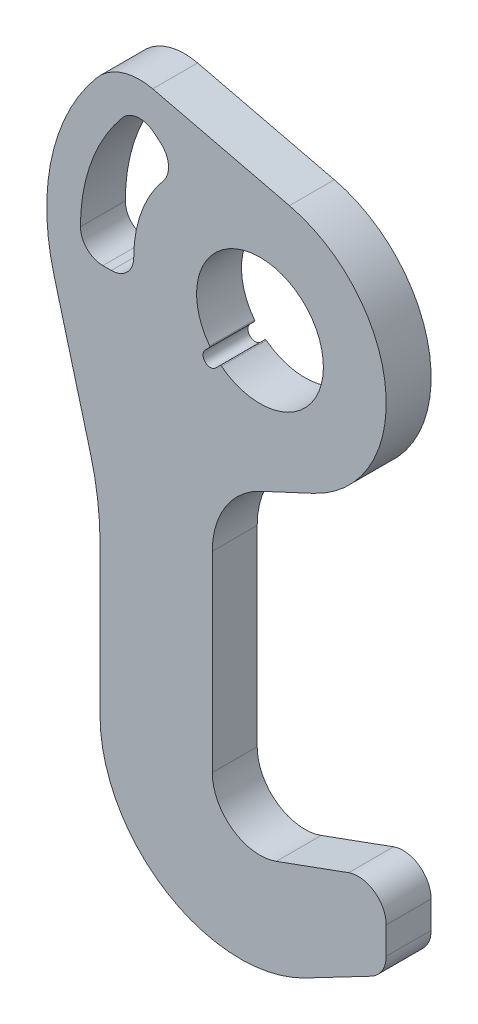
ISO-10303-21;
HEADER;
FILE_DESCRIPTION(('STEP AP214'),'2;1');
FILE_NAME('part.step','',(''),(''),'','','');
FILE_SCHEMA(('AUTOMOTIVE_DESIGN { 1 0 10303 214 1 1 1 1 }'));
ENDSEC;
DATA;
#1=APPLICATION_CONTEXT('core data for automotive mechanical design processes');
#2=APPLICATION_PROTOCOL_DEFINITION('international standard','automotive_design',2000,#1);
#3=PRODUCT_CONTEXT('',#1,'mechanical');
#4=PRODUCT('Part','Part','',(#3));
#5=PRODUCT_RELATED_PRODUCT_CATEGORY('part','',(#4));
#6=PRODUCT_DEFINITION_FORMATION('','',#4);
#7=PRODUCT_DEFINITION_CONTEXT('part definition',#1,'design');
#8=PRODUCT_DEFINITION('design','',#6,#7);
#9=PRODUCT_DEFINITION_SHAPE('','',#8);
#10=(LENGTH_UNIT() NAMED_UNIT(*) SI_UNIT(.MILLI.,.METRE.));
#11=(NAMED_UNIT(*) PLANE_ANGLE_UNIT() SI_UNIT($,.RADIAN.));
#12=(NAMED_UNIT(*) SI_UNIT($,.STERADIAN.) SOLID_ANGLE_UNIT());
#13=UNCERTAINTY_MEASURE_WITH_UNIT(LENGTH_MEASURE(1.E-05),#10,'distance_accuracy_value','');
#14=(GEOMETRIC_REPRESENTATION_CONTEXT(3) GLOBAL_UNCERTAINTY_ASSIGNED_CONTEXT((#13)) GLOBAL_UNIT_ASSIGNED_CONTEXT((#10,
#11,#12)) REPRESENTATION_CONTEXT('',''));
#15=CARTESIAN_POINT('',(0.,0.,0.));
#16=DIRECTION('',(0.,0.,1.));
#17=DIRECTION('',(1.,0.,0.));
#18=AXIS2_PLACEMENT_3D('',#15,#16,#17);
#19=CARTESIAN_POINT('',(0.,-145.,16.0000000000002));
#20=DIRECTION('',(0.,0.,1.));
#21=DIRECTION('',(1.,0.,0.));
#22=AXIS2_PLACEMENT_3D('',#19,#20,#21);
#23=PLANE('',#22);
#24=CARTESIAN_POINT('',(0.,0.,16.0000000000002));
#25=DIRECTION('',(0.,0.,1.));
#26=DIRECTION('',(1.,0.,0.));
#27=AXIS2_PLACEMENT_3D('',#24,#25,#26);
#28=CIRCLE('',#27,22.6);
#29=CARTESIAN_POINT('',(-13.7399961994391,-17.9435922947278,16.0000000000002));
#30=VERTEX_POINT('',#29);
#31=CARTESIAN_POINT('',(-17.9435922947276,-13.7399961994389,16.0000000000002));
#32=VERTEX_POINT('',#31);
#33=EDGE_CURVE('E309',#30,#32,#28,.T.);
#34=ORIENTED_EDGE('',*,*,#33,.F.);
#35=CARTESIAN_POINT('',(-13.9831819728803,-18.2611779990589,16.0000000000002));
#36=DIRECTION('',(0.,0.,-1.));
#37=DIRECTION('',(-1.,0.,0.));
#38=AXIS2_PLACEMENT_3D('',#35,#36,#37);
#39=CIRCLE('',#38,0.4);
#40=CARTESIAN_POINT('',(-14.266024685355,-17.9783352865843,16.0000000000002));
#41=VERTEX_POINT('',#40);
#42=EDGE_CURVE('E307',#41,#30,#39,.T.);
#43=ORIENTED_EDGE('',*,*,#42,.F.);
#44=DIRECTION('',(0.707106781186551,0.707106781186544,0.));
#45=VECTOR('',#44,1.);
#46=CARTESIAN_POINT('',(-15.821514229049,-19.5338248302783,16.0000000000002));
#47=LINE('',#46,#45);
#48=CARTESIAN_POINT('',(-15.821514229049,-19.5338248302783,16.0000000000002));
#49=VERTEX_POINT('',#48);
#50=EDGE_CURVE('E319',#49,#41,#47,.T.);
#51=ORIENTED_EDGE('',*,*,#50,.F.);
#52=CARTESIAN_POINT('',(-17.6776695296638,-17.6776695296637,16.0000000000002));
#53=DIRECTION('',(0.,0.,1.));
#54=DIRECTION('',(-1.,0.,0.));
#55=AXIS2_PLACEMENT_3D('',#52,#53,#54);
#56=CIRCLE('',#55,2.625);
#57=CARTESIAN_POINT('',(-19.5338248302783,-15.821514229049,16.));
#58=VERTEX_POINT('',#57);
#59=EDGE_CURVE('E316',#58,#49,#56,.T.);
#60=ORIENTED_EDGE('',*,*,#59,.F.);
#61=DIRECTION('',(-0.707106781186546,-0.707106781186549,0.));
#62=VECTOR('',#61,1.);
#63=CARTESIAN_POINT('',(-19.5338248302783,-15.821514229049,16.));
#64=LINE('',#63,#62);
#65=CARTESIAN_POINT('',(-17.9783352865843,-14.2660246853552,16.0000000000002));
#66=VERTEX_POINT('',#65);
#67=EDGE_CURVE('E314',#66,#58,#64,.T.);
#68=ORIENTED_EDGE('',*,*,#67,.F.);
#69=CARTESIAN_POINT('',(-18.2611779990589,-13.9831819728804,16.0000000000002));
#70=DIRECTION('',(0.,0.,-1.));
#71=DIRECTION('',(1.,0.,0.));
#72=AXIS2_PLACEMENT_3D('',#69,#70,#71);
#73=CIRCLE('',#72,0.399999999999998);
#74=EDGE_CURVE('E312',#32,#66,#73,.T.);
#75=ORIENTED_EDGE('',*,*,#74,.F.);
#76=EDGE_LOOP('',(#34,#43,#51,#60,#68,#75));
#77=FACE_BOUND('',#76,.T.);
#78=CARTESIAN_POINT('',(0.,-145.,16.0000000000002));
#79=DIRECTION('',(0.,0.,-1.));
#80=DIRECTION('',(1.,0.,0.));
#81=AXIS2_PLACEMENT_3D('',#78,#79,#80);
#82=CIRCLE('',#81,17.);
#83=CARTESIAN_POINT('',(5.81434243653633,-160.974774553361,16.0000000000002));
#84=VERTEX_POINT('',#83);
#85=CARTESIAN_POINT('',(-17.,-145.,16.0000000000002));
#86=VERTEX_POINT('',#85);
#87=EDGE_CURVE('E352',#84,#86,#82,.T.);
#88=ORIENTED_EDGE('',*,*,#87,.T.);
#89=DIRECTION('',(0.,1.,0.));
#90=VECTOR('',#89,1.);
#91=CARTESIAN_POINT('',(-17.,-145.,16.0000000000002));
#92=LINE('',#91,#90);
#93=CARTESIAN_POINT('',(-17.,-76.6913443661719,16.));
#94=VERTEX_POINT('',#93);
#95=EDGE_CURVE('E355',#86,#94,#92,.T.);
#96=ORIENTED_EDGE('',*,*,#95,.T.);
#97=CARTESIAN_POINT('',(12.9999999999999,-76.6913443661719,16.0000000000002));
#98=DIRECTION('',(0.,0.,-1.));
#99=DIRECTION('',(-1.,0.,0.));
#100=AXIS2_PLACEMENT_3D('',#97,#98,#99);
#101=CIRCLE('',#100,30.);
#102=CARTESIAN_POINT('',(0.3214521477789,-49.5021107550724,16.0000000000002));
#103=VERTEX_POINT('',#102);
#104=EDGE_CURVE('E358',#94,#103,#101,.T.);
#105=ORIENTED_EDGE('',*,*,#104,.T.);
#106=DIRECTION('',(0.90630778703665,0.4226182617407,0.));
#107=VECTOR('',#106,1.);
#108=CARTESIAN_POINT('',(0.3214521477789,-49.5021107550724,16.0000000000002));
#109=LINE('',#108,#107);
#110=CARTESIAN_POINT('',(19.0178217783314,-40.7838504166493,16.0000000000002));
#111=VERTEX_POINT('',#110);
#112=EDGE_CURVE('E360',#103,#111,#109,.T.);
#113=ORIENTED_EDGE('',*,*,#112,.T.);
#114=CARTESIAN_POINT('',(0.,0.,16.0000000000002));
#115=DIRECTION('',(0.,0.,1.));
#116=DIRECTION('',(1.,0.,0.));
#117=AXIS2_PLACEMENT_3D('',#114,#115,#116);
#118=CIRCLE('',#117,45.);
#119=CARTESIAN_POINT('',(10.493757672395,43.7593538562104,16.0000000000002));
#120=VERTEX_POINT('',#119);
#121=EDGE_CURVE('E362',#111,#120,#118,.T.);
#122=ORIENTED_EDGE('',*,*,#121,.T.);
#123=DIRECTION('',(-0.972430085693568,0.233194614942114,0.));
#124=VECTOR('',#123,1.);
#125=CARTESIAN_POINT('',(10.493757672395,43.7593538562104,16.0000000000002));
#126=LINE('',#125,#124);
#127=CARTESIAN_POINT('',(-38.2345965158204,55.4447078563176,16.0000000000002));
#128=VERTEX_POINT('',#127);
#129=EDGE_CURVE('E364',#120,#128,#126,.T.);
#130=ORIENTED_EDGE('',*,*,#129,.T.);
#131=CARTESIAN_POINT('',(-42.8984888146627,35.9961061424463,16.0000000000002));
#132=DIRECTION('',(0.,0.,1.));
#133=DIRECTION('',(-1.,0.,0.));
#134=AXIS2_PLACEMENT_3D('',#131,#132,#133);
#135=CIRCLE('',#134,20.);
#136=CARTESIAN_POINT('',(-58.2193776770424,48.851858336177,16.0000000000002));
#137=VERTEX_POINT('',#136);
#138=EDGE_CURVE('E366',#128,#137,#135,.T.);
#139=ORIENTED_EDGE('',*,*,#138,.T.);
#140=CARTESIAN_POINT('',(0.,0.,16.0000000000002));
#141=DIRECTION('',(0.,0.,1.));
#142=DIRECTION('',(-1.,0.,0.));
#143=AXIS2_PLACEMENT_3D('',#140,#141,#142);
#144=CIRCLE('',#143,76.);
#145=CARTESIAN_POINT('',(-73.4103627979693,-19.6702474277912,16.0000000000002));
#146=VERTEX_POINT('',#145);
#147=EDGE_CURVE('E368',#137,#146,#144,.T.);
#148=ORIENTED_EDGE('',*,*,#147,.T.);
#149=DIRECTION('',(0.258819045102514,-0.96592582628907,0.));
#150=VECTOR('',#149,1.);
#151=CARTESIAN_POINT('',(-73.4103627979693,-19.6702474277912,16.0000000000002));
#152=LINE('',#151,#150);
#153=CARTESIAN_POINT('',(-60.4074173710929,-68.1979004089401,16.0000000000002));
#154=VERTEX_POINT('',#153);
#155=EDGE_CURVE('E370',#146,#154,#152,.T.);
#156=ORIENTED_EDGE('',*,*,#155,.T.);
#157=CARTESIAN_POINT('',(-157.,-94.0798049191915,16.0000000000002));
#158=DIRECTION('',(0.,0.,-1.));
#159=DIRECTION('',(-1.,0.,0.));
#160=AXIS2_PLACEMENT_3D('',#157,#158,#159);
#161=CIRCLE('',#160,100.);
#162=CARTESIAN_POINT('',(-56.9999999999999,-94.0798049191915,16.));
#163=VERTEX_POINT('',#162);
#164=EDGE_CURVE('E372',#154,#163,#161,.T.);
#165=ORIENTED_EDGE('',*,*,#164,.T.);
#166=DIRECTION('',(0.,-1.,0.));
#167=VECTOR('',#166,1.);
#168=CARTESIAN_POINT('',(-56.9999999999999,-147.5,16.));
#169=LINE('',#168,#167);
#170=CARTESIAN_POINT('',(-56.9999999999999,-147.5,16.));
#171=VERTEX_POINT('',#170);
#172=EDGE_CURVE('E374',#163,#171,#169,.T.);
#173=ORIENTED_EDGE('',*,*,#172,.T.);
#174=CARTESIAN_POINT('',(-6.9999999999999,-147.5,16.0000000000002));
#175=DIRECTION('',(0.,0.,1.));
#176=DIRECTION('',(1.,0.,0.));
#177=AXIS2_PLACEMENT_3D('',#174,#175,#176);
#178=CIRCLE('',#177,50.);
#179=CARTESIAN_POINT('',(16.1927276459247,-191.795568450376,16.0000000000002));
#180=VERTEX_POINT('',#179);
#181=EDGE_CURVE('E376',#171,#180,#178,.T.);
#182=ORIENTED_EDGE('',*,*,#181,.T.);
#183=DIRECTION('',(0.885911369007522,0.463854552918497,0.));
#184=VECTOR('',#183,1.);
#185=CARTESIAN_POINT('',(39.6385455291852,-179.519566863183,16.0000000000002));
#186=LINE('',#185,#184);
#187=CARTESIAN_POINT('',(39.6385455291852,-179.519566863183,16.0000000000002));
#188=VERTEX_POINT('',#187);
#189=EDGE_CURVE('E378',#180,#188,#186,.T.);
#190=ORIENTED_EDGE('',*,*,#189,.T.);
#191=CARTESIAN_POINT('',(35.0000000000001,-170.660453173108,16.0000000000002));
#192=DIRECTION('',(0.,0.,1.));
#193=DIRECTION('',(-1.,0.,0.));
#194=AXIS2_PLACEMENT_3D('',#191,#192,#193);
#195=CIRCLE('',#194,10.);
#196=CARTESIAN_POINT('',(45.0000000000001,-170.660453173108,16.0000000000002));
#197=VERTEX_POINT('',#196);
#198=EDGE_CURVE('E380',#188,#197,#195,.T.);
#199=ORIENTED_EDGE('',*,*,#198,.T.);
#200=DIRECTION('',(0.,1.,0.));
#201=VECTOR('',#200,1.);
#202=CARTESIAN_POINT('',(45.,-160.993841657532,16.0000000000002));
#203=LINE('',#202,#201);
#204=CARTESIAN_POINT('',(45.,-160.993841657532,16.0000000000002));
#205=VERTEX_POINT('',#204);
#206=EDGE_CURVE('E382',#197,#205,#203,.T.);
#207=ORIENTED_EDGE('',*,*,#206,.T.);
#208=CARTESIAN_POINT('',(35.0000000000001,-160.993841657532,16.0000000000002));
#209=DIRECTION('',(0.,0.,1.));
#210=DIRECTION('',(-1.,0.,0.));
#211=AXIS2_PLACEMENT_3D('',#208,#209,#210);
#212=CIRCLE('',#211,10.);
#213=CARTESIAN_POINT('',(31.5797985667432,-151.596915449673,16.0000000000002));
#214=VERTEX_POINT('',#213);
#215=EDGE_CURVE('E384',#205,#214,#212,.T.);
#216=ORIENTED_EDGE('',*,*,#215,.T.);
#217=DIRECTION('',(-0.939692620785906,-0.342020143325674,0.));
#218=VECTOR('',#217,1.);
#219=CARTESIAN_POINT('',(5.81434243653633,-160.974774553361,16.0000000000002));
#220=LINE('',#219,#218);
#221=EDGE_CURVE('E386',#214,#84,#220,.T.);
#222=ORIENTED_EDGE('',*,*,#221,.T.);
#223=EDGE_LOOP('',(#88,#96,#105,#113,#122,#130,#139,#148,#156,#165,#173,#182,#190,#199,#207,
#216,#222));
#224=FACE_BOUND('',#223,.T.);
#225=DIRECTION('',(-0.766044443118978,0.642787609686539,0.));
#226=VECTOR('',#225,1.);
#227=CARTESIAN_POINT('',(-35.4580546078135,40.1960988583385,16.0000000000002));
#228=LINE('',#227,#226);
#229=CARTESIAN_POINT('',(-35.4580546078135,40.1960988583385,16.0000000000002));
#230=VERTEX_POINT('',#229);
#231=CARTESIAN_POINT('',(-37.7561879371704,42.1244616873981,16.0000000000002));
#232=VERTEX_POINT('',#231);
#233=EDGE_CURVE('E250',#230,#232,#228,.T.);
#234=ORIENTED_EDGE('',*,*,#233,.F.);
#235=CARTESIAN_POINT('',(-40.6003554853057,34.0677433133867,16.));
#236=DIRECTION('',(0.,0.,1.));
#237=DIRECTION('',(-1.,0.,0.));
#238=AXIS2_PLACEMENT_3D('',#235,#236,#237);
#239=CIRCLE('',#238,8.00000000000004);
#240=CARTESIAN_POINT('',(-34.4719999403539,28.9254424358945,16.0000000000002));
#241=VERTEX_POINT('',#240);
#242=EDGE_CURVE('E242',#241,#230,#239,.T.);
#243=ORIENTED_EDGE('',*,*,#242,.F.);
#244=CARTESIAN_POINT('',(0.,0.,16.0000000000002));
#245=DIRECTION('',(0.,0.,-1.));
#246=DIRECTION('',(1.,0.,0.));
#247=AXIS2_PLACEMENT_3D('',#244,#245,#246);
#248=CIRCLE('',#247,45.);
#249=CARTESIAN_POINT('',(-45.0000000000001,0.,16.0000000000002));
#250=VERTEX_POINT('',#249);
#251=EDGE_CURVE('E275',#250,#241,#248,.T.);
#252=ORIENTED_EDGE('',*,*,#251,.F.);
#253=CARTESIAN_POINT('',(-53.,0.,16.0000000000002));
#254=DIRECTION('',(0.,0.,1.));
#255=DIRECTION('',(1.,0.,0.));
#256=AXIS2_PLACEMENT_3D('',#253,#254,#255);
#257=CIRCLE('',#256,8.);
#258=CARTESIAN_POINT('',(-53.,-8.00000000000001,16.0000000000002));
#259=VERTEX_POINT('',#258);
#260=EDGE_CURVE('E273',#259,#250,#257,.T.);
#261=ORIENTED_EDGE('',*,*,#260,.F.);
#262=DIRECTION('',(1.,0.,0.));
#263=VECTOR('',#262,1.);
#264=CARTESIAN_POINT('',(-53.,-8.00000000000001,16.0000000000002));
#265=LINE('',#264,#263);
#266=CARTESIAN_POINT('',(-56.,-8.00000000000001,16.0000000000002));
#267=VERTEX_POINT('',#266);
#268=EDGE_CURVE('E271',#267,#259,#265,.T.);
#269=ORIENTED_EDGE('',*,*,#268,.F.);
#270=CARTESIAN_POINT('',(-56.0000000000002,0.,16.0000000000002));
#271=DIRECTION('',(0.,0.,1.));
#272=DIRECTION('',(1.,0.,0.));
#273=AXIS2_PLACEMENT_3D('',#270,#271,#272);
#274=CIRCLE('',#273,8.);
#275=CARTESIAN_POINT('',(-64.0000000000001,0.,16.0000000000002));
#276=VERTEX_POINT('',#275);
#277=EDGE_CURVE('E269',#276,#267,#274,.T.);
#278=ORIENTED_EDGE('',*,*,#277,.F.);
#279=CARTESIAN_POINT('',(0.,0.,16.0000000000002));
#280=DIRECTION('',(0.,0.,1.));
#281=DIRECTION('',(1.,0.,0.));
#282=AXIS2_PLACEMENT_3D('',#279,#280,#281);
#283=CIRCLE('',#282,64.);
#284=CARTESIAN_POINT('',(-49.0268443596145,41.1384070199388,16.0000000000002));
#285=VERTEX_POINT('',#284);
#286=EDGE_CURVE('E265',#285,#276,#283,.T.);
#287=ORIENTED_EDGE('',*,*,#286,.F.);
#288=CARTESIAN_POINT('',(-42.8984888146627,35.9961061424463,16.0000000000002));
#289=DIRECTION('',(0.,0.,1.));
#290=DIRECTION('',(-1.,0.,0.));
#291=AXIS2_PLACEMENT_3D('',#288,#289,#290);
#292=CIRCLE('',#291,8.00000000000001);
#293=EDGE_CURVE('E263',#232,#285,#292,.T.);
#294=ORIENTED_EDGE('',*,*,#293,.F.);
#295=EDGE_LOOP('',(#234,#243,#252,#261,#269,#278,#287,#294));
#296=FACE_BOUND('',#295,.T.);
#297=ADVANCED_FACE('F39',(#77,#224,#296),#23,.T.);
#298=CARTESIAN_POINT('',(-1.11022302462516E-13,-145.,2.22044604925031E-13));
#299=DIRECTION('',(0.,0.,1.));
#300=DIRECTION('',(1.,0.,0.));
#301=AXIS2_PLACEMENT_3D('',#298,#299,#300);
#302=PLANE('',#301);
#303=CARTESIAN_POINT('',(-13.9831819728803,-18.2611779990589,2.22044604925031E-13));
#304=DIRECTION('',(0.,0.,-1.));
#305=DIRECTION('',(-1.,0.,0.));
#306=AXIS2_PLACEMENT_3D('',#303,#304,#305);
#307=CIRCLE('',#306,0.4);
#308=CARTESIAN_POINT('',(-14.2660246853549,-17.9783352865845,2.22044604925031E-13));
#309=VERTEX_POINT('',#308);
#310=CARTESIAN_POINT('',(-13.739996199439,-17.9435922947275,2.22044604925031E-13));
#311=VERTEX_POINT('',#310);
#312=EDGE_CURVE('E258',#309,#311,#307,.T.);
#313=ORIENTED_EDGE('',*,*,#312,.T.);
#314=CARTESIAN_POINT('',(0.,0.,2.22044604925031E-13));
#315=DIRECTION('',(0.,0.,1.));
#316=DIRECTION('',(1.,0.,0.));
#317=AXIS2_PLACEMENT_3D('',#314,#315,#316);
#318=CIRCLE('',#317,22.6);
#319=CARTESIAN_POINT('',(-17.9435922947276,-13.7399961994389,0.));
#320=VERTEX_POINT('',#319);
#321=EDGE_CURVE('E324',#311,#320,#318,.T.);
#322=ORIENTED_EDGE('',*,*,#321,.T.);
#323=CARTESIAN_POINT('',(-18.261177999059,-13.9831819728804,2.22044604925031E-13));
#324=DIRECTION('',(0.,0.,-1.));
#325=DIRECTION('',(1.,0.,0.));
#326=AXIS2_PLACEMENT_3D('',#323,#324,#325);
#327=CIRCLE('',#326,0.399999999999998);
#328=CARTESIAN_POINT('',(-17.9783352865844,-14.266024685355,0.));
#329=VERTEX_POINT('',#328);
#330=EDGE_CURVE('E327',#320,#329,#327,.T.);
#331=ORIENTED_EDGE('',*,*,#330,.T.);
#332=DIRECTION('',(-0.707106781186546,-0.707106781186549,0.));
#333=VECTOR('',#332,1.);
#334=CARTESIAN_POINT('',(-19.5338248302783,-15.821514229049,2.22044604925031E-13));
#335=LINE('',#334,#333);
#336=CARTESIAN_POINT('',(-19.5338248302783,-15.821514229049,2.22044604925031E-13));
#337=VERTEX_POINT('',#336);
#338=EDGE_CURVE('E330',#329,#337,#335,.T.);
#339=ORIENTED_EDGE('',*,*,#338,.T.);
#340=CARTESIAN_POINT('',(-17.6776695296638,-17.6776695296637,2.22044604925031E-13));
#341=DIRECTION('',(0.,0.,1.));
#342=DIRECTION('',(-1.,0.,0.));
#343=AXIS2_PLACEMENT_3D('',#340,#341,#342);
#344=CIRCLE('',#343,2.625);
#345=CARTESIAN_POINT('',(-15.821514229049,-19.5338248302783,2.22044604925031E-13));
#346=VERTEX_POINT('',#345);
#347=EDGE_CURVE('E333',#337,#346,#344,.T.);
#348=ORIENTED_EDGE('',*,*,#347,.T.);
#349=DIRECTION('',(0.707106781186551,0.707106781186544,0.));
#350=VECTOR('',#349,1.);
#351=CARTESIAN_POINT('',(-15.821514229049,-19.5338248302783,2.22044604925031E-13));
#352=LINE('',#351,#350);
#353=EDGE_CURVE('E310',#346,#309,#352,.T.);
#354=ORIENTED_EDGE('',*,*,#353,.T.);
#355=EDGE_LOOP('',(#313,#322,#331,#339,#348,#354));
#356=FACE_BOUND('',#355,.T.);
#357=CARTESIAN_POINT('',(-1.11022302462516E-13,-145.,2.22044604925031E-13));
#358=DIRECTION('',(0.,0.,-1.));
#359=DIRECTION('',(1.,0.,0.));
#360=AXIS2_PLACEMENT_3D('',#357,#358,#359);
#361=CIRCLE('',#360,17.);
#362=CARTESIAN_POINT('',(5.81434243653633,-160.974774553361,2.22044604925031E-13));
#363=VERTEX_POINT('',#362);
#364=CARTESIAN_POINT('',(-16.9999999999999,-145.,2.22044604925031E-13));
#365=VERTEX_POINT('',#364);
#366=EDGE_CURVE('E351',#363,#365,#361,.T.);
#367=ORIENTED_EDGE('',*,*,#366,.F.);
#368=DIRECTION('',(-0.939692620785906,-0.342020143325674,0.));
#369=VECTOR('',#368,1.);
#370=CARTESIAN_POINT('',(5.81434243653633,-160.974774553361,2.22044604925031E-13));
#371=LINE('',#370,#369);
#372=CARTESIAN_POINT('',(31.5797985667433,-151.596915449673,2.22044604925031E-13));
#373=VERTEX_POINT('',#372);
#374=EDGE_CURVE('E356',#373,#363,#371,.T.);
#375=ORIENTED_EDGE('',*,*,#374,.F.);
#376=CARTESIAN_POINT('',(34.9999999999999,-160.993841657532,0.));
#377=DIRECTION('',(0.,0.,1.));
#378=DIRECTION('',(-1.,0.,0.));
#379=AXIS2_PLACEMENT_3D('',#376,#377,#378);
#380=CIRCLE('',#379,10.);
#381=CARTESIAN_POINT('',(45.,-160.993841657532,2.22044604925031E-13));
#382=VERTEX_POINT('',#381);
#383=EDGE_CURVE('E419',#382,#373,#380,.T.);
#384=ORIENTED_EDGE('',*,*,#383,.F.);
#385=DIRECTION('',(0.,1.,0.));
#386=VECTOR('',#385,1.);
#387=CARTESIAN_POINT('',(45.,-160.993841657532,2.22044604925031E-13));
#388=LINE('',#387,#386);
#389=CARTESIAN_POINT('',(45.0000000000003,-170.660453173108,2.22044604925031E-13));
#390=VERTEX_POINT('',#389);
#391=EDGE_CURVE('E417',#390,#382,#388,.T.);
#392=ORIENTED_EDGE('',*,*,#391,.F.);
#393=CARTESIAN_POINT('',(35.0000000000003,-170.660453173108,2.22044604925031E-13));
#394=DIRECTION('',(0.,0.,1.));
#395=DIRECTION('',(-1.,0.,0.));
#396=AXIS2_PLACEMENT_3D('',#393,#394,#395);
#397=CIRCLE('',#396,10.);
#398=CARTESIAN_POINT('',(39.6385455291852,-179.519566863183,2.22044604925031E-13));
#399=VERTEX_POINT('',#398);
#400=EDGE_CURVE('E415',#399,#390,#397,.T.);
#401=ORIENTED_EDGE('',*,*,#400,.F.);
#402=DIRECTION('',(0.885911369007522,0.463854552918497,0.));
#403=VECTOR('',#402,1.);
#404=CARTESIAN_POINT('',(39.6385455291852,-179.519566863183,2.22044604925031E-13));
#405=LINE('',#404,#403);
#406=CARTESIAN_POINT('',(16.1927276459247,-191.795568450376,2.22044604925031E-13));
#407=VERTEX_POINT('',#406);
#408=EDGE_CURVE('E413',#407,#399,#405,.T.);
#409=ORIENTED_EDGE('',*,*,#408,.F.);
#410=CARTESIAN_POINT('',(-6.9999999999999,-147.5,2.22044604925031E-13));
#411=DIRECTION('',(0.,0.,1.));
#412=DIRECTION('',(1.,0.,0.));
#413=AXIS2_PLACEMENT_3D('',#410,#411,#412);
#414=CIRCLE('',#413,50.);
#415=CARTESIAN_POINT('',(-56.9999999999999,-147.5,2.22044604925031E-13));
#416=VERTEX_POINT('',#415);
#417=EDGE_CURVE('E411',#416,#407,#414,.T.);
#418=ORIENTED_EDGE('',*,*,#417,.F.);
#419=DIRECTION('',(0.,-1.,0.));
#420=VECTOR('',#419,1.);
#421=CARTESIAN_POINT('',(-56.9999999999999,-147.5,2.22044604925031E-13));
#422=LINE('',#421,#420);
#423=CARTESIAN_POINT('',(-56.9999999999999,-94.0798049191915,2.22044604925031E-13));
#424=VERTEX_POINT('',#423);
#425=EDGE_CURVE('E409',#424,#416,#422,.T.);
#426=ORIENTED_EDGE('',*,*,#425,.F.);
#427=CARTESIAN_POINT('',(-157.,-94.0798049191915,2.22044604925031E-13));
#428=DIRECTION('',(0.,0.,-1.));
#429=DIRECTION('',(-1.,0.,0.));
#430=AXIS2_PLACEMENT_3D('',#427,#428,#429);
#431=CIRCLE('',#430,100.);
#432=CARTESIAN_POINT('',(-60.4074173710929,-68.1979004089401,2.22044604925031E-13));
#433=VERTEX_POINT('',#432);
#434=EDGE_CURVE('E407',#433,#424,#431,.T.);
#435=ORIENTED_EDGE('',*,*,#434,.F.);
#436=DIRECTION('',(0.258819045102514,-0.96592582628907,0.));
#437=VECTOR('',#436,1.);
#438=CARTESIAN_POINT('',(-73.4103627979693,-19.6702474277912,2.22044604925031E-13));
#439=LINE('',#438,#437);
#440=CARTESIAN_POINT('',(-73.4103627979693,-19.6702474277912,2.22044604925031E-13));
#441=VERTEX_POINT('',#440);
#442=EDGE_CURVE('E405',#441,#433,#439,.T.);
#443=ORIENTED_EDGE('',*,*,#442,.F.);
#444=CARTESIAN_POINT('',(0.,0.,2.22044604925031E-13));
#445=DIRECTION('',(0.,0.,1.));
#446=DIRECTION('',(-1.,0.,0.));
#447=AXIS2_PLACEMENT_3D('',#444,#445,#446);
#448=CIRCLE('',#447,76.);
#449=CARTESIAN_POINT('',(-58.2193776770423,48.851858336177,2.22044604925031E-13));
#450=VERTEX_POINT('',#449);
#451=EDGE_CURVE('E403',#450,#441,#448,.T.);
#452=ORIENTED_EDGE('',*,*,#451,.F.);
#453=CARTESIAN_POINT('',(-42.8984888146626,35.9961061424463,2.22044604925031E-13));
#454=DIRECTION('',(0.,0.,1.));
#455=DIRECTION('',(-1.,0.,0.));
#456=AXIS2_PLACEMENT_3D('',#453,#454,#455);
#457=CIRCLE('',#456,20.);
#458=CARTESIAN_POINT('',(-38.2345965158204,55.4447078563176,2.22044604925031E-13));
#459=VERTEX_POINT('',#458);
#460=EDGE_CURVE('E401',#459,#450,#457,.T.);
#461=ORIENTED_EDGE('',*,*,#460,.F.);
#462=DIRECTION('',(-0.972430085693568,0.233194614942114,0.));
#463=VECTOR('',#462,1.);
#464=CARTESIAN_POINT('',(10.4937576723951,43.7593538562104,2.22044604925031E-13));
#465=LINE('',#464,#463);
#466=CARTESIAN_POINT('',(10.4937576723951,43.7593538562104,2.22044604925031E-13));
#467=VERTEX_POINT('',#466);
#468=EDGE_CURVE('E399',#467,#459,#465,.T.);
#469=ORIENTED_EDGE('',*,*,#468,.F.);
#470=CARTESIAN_POINT('',(0.,0.,2.22044604925031E-13));
#471=DIRECTION('',(0.,0.,1.));
#472=DIRECTION('',(1.,0.,0.));
#473=AXIS2_PLACEMENT_3D('',#470,#471,#472);
#474=CIRCLE('',#473,45.);
#475=CARTESIAN_POINT('',(19.0178217783314,-40.7838504166493,2.22044604925031E-13));
#476=VERTEX_POINT('',#475);
#477=EDGE_CURVE('E397',#476,#467,#474,.T.);
#478=ORIENTED_EDGE('',*,*,#477,.F.);
#479=DIRECTION('',(0.90630778703665,0.4226182617407,0.));
#480=VECTOR('',#479,1.);
#481=CARTESIAN_POINT('',(0.3214521477789,-49.5021107550724,2.22044604925031E-13));
#482=LINE('',#481,#480);
#483=CARTESIAN_POINT('',(0.3214521477789,-49.5021107550724,2.22044604925031E-13));
#484=VERTEX_POINT('',#483);
#485=EDGE_CURVE('E395',#484,#476,#482,.T.);
#486=ORIENTED_EDGE('',*,*,#485,.F.);
#487=CARTESIAN_POINT('',(13.,-76.6913443661719,2.22044604925031E-13));
#488=DIRECTION('',(0.,0.,-1.));
#489=DIRECTION('',(-1.,0.,0.));
#490=AXIS2_PLACEMENT_3D('',#487,#488,#489);
#491=CIRCLE('',#490,30.);
#492=CARTESIAN_POINT('',(-17.,-76.6913443661719,2.22044604925031E-13));
#493=VERTEX_POINT('',#492);
#494=EDGE_CURVE('E393',#493,#484,#491,.T.);
#495=ORIENTED_EDGE('',*,*,#494,.F.);
#496=DIRECTION('',(0.,1.,0.));
#497=VECTOR('',#496,1.);
#498=CARTESIAN_POINT('',(-16.9999999999999,-145.,2.22044604925031E-13));
#499=LINE('',#498,#497);
#500=EDGE_CURVE('E391',#365,#493,#499,.T.);
#501=ORIENTED_EDGE('',*,*,#500,.F.);
#502=EDGE_LOOP('',(#367,#375,#384,#392,#401,#409,#418,#426,#435,#443,#452,#461,#469,#478,#486,
#495,#501));
#503=FACE_BOUND('',#502,.T.);
#504=CARTESIAN_POINT('',(-40.6003554853057,34.0677433133867,0.));
#505=DIRECTION('',(0.,0.,1.));
#506=DIRECTION('',(-1.,0.,0.));
#507=AXIS2_PLACEMENT_3D('',#504,#505,#506);
#508=CIRCLE('',#507,8.00000000000004);
#509=CARTESIAN_POINT('',(-34.471999940354,28.9254424358945,0.));
#510=VERTEX_POINT('',#509);
#511=CARTESIAN_POINT('',(-35.4580546078135,40.1960988583385,2.22044604925031E-13));
#512=VERTEX_POINT('',#511);
#513=EDGE_CURVE('E62',#510,#512,#508,.T.);
#514=ORIENTED_EDGE('',*,*,#513,.T.);
#515=DIRECTION('',(-0.766044443118978,0.642787609686539,0.));
#516=VECTOR('',#515,1.);
#517=CARTESIAN_POINT('',(-35.4580546078135,40.1960988583385,2.22044604925031E-13));
#518=LINE('',#517,#516);
#519=CARTESIAN_POINT('',(-37.7561879371704,42.1244616873981,2.22044604925031E-13));
#520=VERTEX_POINT('',#519);
#521=EDGE_CURVE('E257',#512,#520,#518,.T.);
#522=ORIENTED_EDGE('',*,*,#521,.T.);
#523=CARTESIAN_POINT('',(-42.8984888146626,35.9961061424463,2.22044604925031E-13));
#524=DIRECTION('',(0.,0.,1.));
#525=DIRECTION('',(-1.,0.,0.));
#526=AXIS2_PLACEMENT_3D('',#523,#524,#525);
#527=CIRCLE('',#526,8.00000000000001);
#528=CARTESIAN_POINT('',(-49.0268443596145,41.1384070199388,2.22044604925031E-13));
#529=VERTEX_POINT('',#528);
#530=EDGE_CURVE('E279',#520,#529,#527,.T.);
#531=ORIENTED_EDGE('',*,*,#530,.T.);
#532=CARTESIAN_POINT('',(0.,0.,2.22044604925031E-13));
#533=DIRECTION('',(0.,0.,1.));
#534=DIRECTION('',(1.,0.,0.));
#535=AXIS2_PLACEMENT_3D('',#532,#533,#534);
#536=CIRCLE('',#535,64.);
#537=CARTESIAN_POINT('',(-64.0000000000001,0.,2.22044604925031E-13));
#538=VERTEX_POINT('',#537);
#539=EDGE_CURVE('E282',#529,#538,#536,.T.);
#540=ORIENTED_EDGE('',*,*,#539,.T.);
#541=CARTESIAN_POINT('',(-56.0000000000002,0.,2.22044604925031E-13));
#542=DIRECTION('',(0.,0.,1.));
#543=DIRECTION('',(1.,0.,0.));
#544=AXIS2_PLACEMENT_3D('',#541,#542,#543);
#545=CIRCLE('',#544,8.);
#546=CARTESIAN_POINT('',(-56.,-8.00000000000001,2.22044604925031E-13));
#547=VERTEX_POINT('',#546);
#548=EDGE_CURVE('E285',#538,#547,#545,.T.);
#549=ORIENTED_EDGE('',*,*,#548,.T.);
#550=DIRECTION('',(1.,0.,0.));
#551=VECTOR('',#550,1.);
#552=CARTESIAN_POINT('',(-53.,-8.00000000000001,2.22044604925031E-13));
#553=LINE('',#552,#551);
#554=CARTESIAN_POINT('',(-53.,-8.00000000000001,2.22044604925031E-13));
#555=VERTEX_POINT('',#554);
#556=EDGE_CURVE('E288',#547,#555,#553,.T.);
#557=ORIENTED_EDGE('',*,*,#556,.T.);
#558=CARTESIAN_POINT('',(-52.9999999999999,0.,2.22044604925031E-13));
#559=DIRECTION('',(0.,0.,1.));
#560=DIRECTION('',(1.,0.,0.));
#561=AXIS2_PLACEMENT_3D('',#558,#559,#560);
#562=CIRCLE('',#561,8.);
#563=CARTESIAN_POINT('',(-45.,0.,2.22044604925031E-13));
#564=VERTEX_POINT('',#563);
#565=EDGE_CURVE('E291',#555,#564,#562,.T.);
#566=ORIENTED_EDGE('',*,*,#565,.T.);
#567=CARTESIAN_POINT('',(0.,0.,2.22044604925031E-13));
#568=DIRECTION('',(0.,0.,-1.));
#569=DIRECTION('',(1.,0.,0.));
#570=AXIS2_PLACEMENT_3D('',#567,#568,#569);
#571=CIRCLE('',#570,45.);
#572=EDGE_CURVE('E251',#564,#510,#571,.T.);
#573=ORIENTED_EDGE('',*,*,#572,.T.);
#574=EDGE_LOOP('',(#514,#522,#531,#540,#549,#557,#566,#573));
#575=FACE_BOUND('',#574,.T.);
#576=ADVANCED_FACE('F476',(#356,#503,#575),#302,.F.);
#577=CARTESIAN_POINT('',(0.,-145.,16.0000000000002));
#578=DIRECTION('',(0.,0.,-1.));
#579=DIRECTION('',(-1.,0.,0.));
#580=AXIS2_PLACEMENT_3D('',#577,#578,#579);
#581=CYLINDRICAL_SURFACE('',#580,17.);
#582=ORIENTED_EDGE('',*,*,#366,.T.);
#583=DIRECTION('',(0.,0.,-1.));
#584=VECTOR('',#583,1.);
#585=CARTESIAN_POINT('',(-17.,-145.,16.0000000000002));
#586=LINE('',#585,#584);
#587=EDGE_CURVE('E11',#86,#365,#586,.T.);
#588=ORIENTED_EDGE('',*,*,#587,.F.);
#589=ORIENTED_EDGE('',*,*,#87,.F.);
#590=DIRECTION('',(0.,0.,-1.));
#591=VECTOR('',#590,1.);
#592=CARTESIAN_POINT('',(5.81434243653633,-160.974774553361,16.0000000000002));
#593=LINE('',#592,#591);
#594=EDGE_CURVE('E388',#84,#363,#593,.T.);
#595=ORIENTED_EDGE('',*,*,#594,.T.);
#596=EDGE_LOOP('',(#582,#588,#589,#595));
#597=FACE_BOUND('',#596,.T.);
#598=ADVANCED_FACE('F41',(#597),#581,.F.);
#599=CARTESIAN_POINT('',(-17.,-145.,16.0000000000002));
#600=DIRECTION('',(-1.,0.,0.));
#601=DIRECTION('',(0.,0.,1.));
#602=AXIS2_PLACEMENT_3D('',#599,#600,#601);
#603=PLANE('',#602);
#604=ORIENTED_EDGE('',*,*,#500,.T.);
#605=DIRECTION('',(0.,0.,-1.));
#606=VECTOR('',#605,1.);
#607=CARTESIAN_POINT('',(-17.,-76.6913443661719,16.));
#608=LINE('',#607,#606);
#609=EDGE_CURVE('E47',#94,#493,#608,.T.);
#610=ORIENTED_EDGE('',*,*,#609,.F.);
#611=ORIENTED_EDGE('',*,*,#95,.F.);
#612=ORIENTED_EDGE('',*,*,#587,.T.);
#613=EDGE_LOOP('',(#604,#610,#611,#612));
#614=FACE_BOUND('',#613,.T.);
#615=ADVANCED_FACE('F493',(#614),#603,.F.);
#616=CARTESIAN_POINT('',(12.9999999999999,-76.6913443661719,16.0000000000002));
#617=DIRECTION('',(0.,0.,-1.));
#618=DIRECTION('',(-1.,0.,0.));
#619=AXIS2_PLACEMENT_3D('',#616,#617,#618);
#620=CYLINDRICAL_SURFACE('',#619,30.);
#621=ORIENTED_EDGE('',*,*,#494,.T.);
#622=DIRECTION('',(0.,0.,-1.));
#623=VECTOR('',#622,1.);
#624=CARTESIAN_POINT('',(0.3214521477789,-49.5021107550724,16.0000000000002));
#625=LINE('',#624,#623);
#626=EDGE_CURVE('E463',#103,#484,#625,.T.);
#627=ORIENTED_EDGE('',*,*,#626,.F.);
#628=ORIENTED_EDGE('',*,*,#104,.F.);
#629=ORIENTED_EDGE('',*,*,#609,.T.);
#630=EDGE_LOOP('',(#621,#627,#628,#629));
#631=FACE_BOUND('',#630,.T.);
#632=ADVANCED_FACE('F470',(#631),#620,.F.);
#633=CARTESIAN_POINT('',(0.3214521477789,-49.5021107550724,16.0000000000002));
#634=DIRECTION('',(-0.4226182617407,0.90630778703665,0.));
#635=DIRECTION('',(-0.90630778703665,-0.4226182617407,0.));
#636=AXIS2_PLACEMENT_3D('',#633,#634,#635);
#637=PLANE('',#636);
#638=ORIENTED_EDGE('',*,*,#485,.T.);
#639=DIRECTION('',(0.,0.,-1.));
#640=VECTOR('',#639,1.);
#641=CARTESIAN_POINT('',(19.0178217783314,-40.7838504166493,16.0000000000002));
#642=LINE('',#641,#640);
#643=EDGE_CURVE('E460',#111,#476,#642,.T.);
#644=ORIENTED_EDGE('',*,*,#643,.F.);
#645=ORIENTED_EDGE('',*,*,#112,.F.);
#646=ORIENTED_EDGE('',*,*,#626,.T.);
#647=EDGE_LOOP('',(#638,#644,#645,#646));
#648=FACE_BOUND('',#647,.T.);
#649=ADVANCED_FACE('F482',(#648),#637,.F.);
#650=CARTESIAN_POINT('',(0.,0.,16.0000000000002));
#651=DIRECTION('',(0.,0.,-1.));
#652=DIRECTION('',(-1.,0.,0.));
#653=AXIS2_PLACEMENT_3D('',#650,#651,#652);
#654=CYLINDRICAL_SURFACE('',#653,45.);
#655=ORIENTED_EDGE('',*,*,#477,.T.);
#656=DIRECTION('',(0.,0.,-1.));
#657=VECTOR('',#656,1.);
#658=CARTESIAN_POINT('',(10.493757672395,43.7593538562104,16.0000000000002));
#659=LINE('',#658,#657);
#660=EDGE_CURVE('E457',#120,#467,#659,.T.);
#661=ORIENTED_EDGE('',*,*,#660,.F.);
#662=ORIENTED_EDGE('',*,*,#121,.F.);
#663=ORIENTED_EDGE('',*,*,#643,.T.);
#664=EDGE_LOOP('',(#655,#661,#662,#663));
#665=FACE_BOUND('',#664,.T.);
#666=ADVANCED_FACE('F486',(#665),#654,.T.);
#667=CARTESIAN_POINT('',(10.493757672395,43.7593538562104,16.0000000000002));
#668=DIRECTION('',(-0.233194614942114,-0.972430085693568,0.));
#669=DIRECTION('',(0.972430085693568,-0.233194614942114,0.));
#670=AXIS2_PLACEMENT_3D('',#667,#668,#669);
#671=PLANE('',#670);
#672=ORIENTED_EDGE('',*,*,#468,.T.);
#673=DIRECTION('',(0.,0.,-1.));
#674=VECTOR('',#673,1.);
#675=CARTESIAN_POINT('',(-38.2345965158204,55.4447078563176,16.0000000000002));
#676=LINE('',#675,#674);
#677=EDGE_CURVE('E454',#128,#459,#676,.T.);
#678=ORIENTED_EDGE('',*,*,#677,.F.);
#679=ORIENTED_EDGE('',*,*,#129,.F.);
#680=ORIENTED_EDGE('',*,*,#660,.T.);
#681=EDGE_LOOP('',(#672,#678,#679,#680));
#682=FACE_BOUND('',#681,.T.);
#683=ADVANCED_FACE('F551',(#682),#671,.F.);
#684=CARTESIAN_POINT('',(-42.8984888146627,35.9961061424463,16.0000000000002));
#685=DIRECTION('',(0.,0.,-1.));
#686=DIRECTION('',(-1.,0.,0.));
#687=AXIS2_PLACEMENT_3D('',#684,#685,#686);
#688=CYLINDRICAL_SURFACE('',#687,20.);
#689=ORIENTED_EDGE('',*,*,#460,.T.);
#690=DIRECTION('',(0.,0.,-1.));
#691=VECTOR('',#690,1.);
#692=CARTESIAN_POINT('',(-58.2193776770424,48.851858336177,16.0000000000002));
#693=LINE('',#692,#691);
#694=EDGE_CURVE('E451',#137,#450,#693,.T.);
#695=ORIENTED_EDGE('',*,*,#694,.F.);
#696=ORIENTED_EDGE('',*,*,#138,.F.);
#697=ORIENTED_EDGE('',*,*,#677,.T.);
#698=EDGE_LOOP('',(#689,#695,#696,#697));
#699=FACE_BOUND('',#698,.T.);
#700=ADVANCED_FACE('F549',(#699),#688,.T.);
#701=CARTESIAN_POINT('',(0.,0.,16.0000000000002));
#702=DIRECTION('',(0.,0.,-1.));
#703=DIRECTION('',(-1.,0.,0.));
#704=AXIS2_PLACEMENT_3D('',#701,#702,#703);
#705=CYLINDRICAL_SURFACE('',#704,76.);
#706=ORIENTED_EDGE('',*,*,#451,.T.);
#707=DIRECTION('',(0.,0.,-1.));
#708=VECTOR('',#707,1.);
#709=CARTESIAN_POINT('',(-73.4103627979693,-19.6702474277912,16.0000000000002));
#710=LINE('',#709,#708);
#711=EDGE_CURVE('E448',#146,#441,#710,.T.);
#712=ORIENTED_EDGE('',*,*,#711,.F.);
#713=ORIENTED_EDGE('',*,*,#147,.F.);
#714=ORIENTED_EDGE('',*,*,#694,.T.);
#715=EDGE_LOOP('',(#706,#712,#713,#714));
#716=FACE_BOUND('',#715,.T.);
#717=ADVANCED_FACE('F544',(#716),#705,.T.);
#718=CARTESIAN_POINT('',(-73.4103627979693,-19.6702474277912,16.0000000000002));
#719=DIRECTION('',(0.96592582628907,0.258819045102514,0.));
#720=DIRECTION('',(-0.258819045102514,0.96592582628907,0.));
#721=AXIS2_PLACEMENT_3D('',#718,#719,#720);
#722=PLANE('',#721);
#723=ORIENTED_EDGE('',*,*,#442,.T.);
#724=DIRECTION('',(0.,0.,-1.));
#725=VECTOR('',#724,1.);
#726=CARTESIAN_POINT('',(-60.4074173710929,-68.1979004089401,16.0000000000002));
#727=LINE('',#726,#725);
#728=EDGE_CURVE('E445',#154,#433,#727,.T.);
#729=ORIENTED_EDGE('',*,*,#728,.F.);
#730=ORIENTED_EDGE('',*,*,#155,.F.);
#731=ORIENTED_EDGE('',*,*,#711,.T.);
#732=EDGE_LOOP('',(#723,#729,#730,#731));
#733=FACE_BOUND('',#732,.T.);
#734=ADVANCED_FACE('F539',(#733),#722,.F.);
#735=CARTESIAN_POINT('',(-157.,-94.0798049191915,16.0000000000002));
#736=DIRECTION('',(0.,0.,-1.));
#737=DIRECTION('',(-1.,0.,0.));
#738=AXIS2_PLACEMENT_3D('',#735,#736,#737);
#739=CYLINDRICAL_SURFACE('',#738,100.);
#740=ORIENTED_EDGE('',*,*,#434,.T.);
#741=DIRECTION('',(0.,0.,-1.));
#742=VECTOR('',#741,1.);
#743=CARTESIAN_POINT('',(-56.9999999999999,-94.0798049191915,16.));
#744=LINE('',#743,#742);
#745=EDGE_CURVE('E442',#163,#424,#744,.T.);
#746=ORIENTED_EDGE('',*,*,#745,.F.);
#747=ORIENTED_EDGE('',*,*,#164,.F.);
#748=ORIENTED_EDGE('',*,*,#728,.T.);
#749=EDGE_LOOP('',(#740,#746,#747,#748));
#750=FACE_BOUND('',#749,.T.);
#751=ADVANCED_FACE('F535',(#750),#739,.F.);
#752=CARTESIAN_POINT('',(-56.9999999999999,-147.5,16.));
#753=DIRECTION('',(1.,0.,0.));
#754=DIRECTION('',(0.,1.,0.));
#755=AXIS2_PLACEMENT_3D('',#752,#753,#754);
#756=PLANE('',#755);
#757=ORIENTED_EDGE('',*,*,#425,.T.);
#758=DIRECTION('',(0.,0.,-1.));
#759=VECTOR('',#758,1.);
#760=CARTESIAN_POINT('',(-56.9999999999999,-147.5,16.));
#761=LINE('',#760,#759);
#762=EDGE_CURVE('E439',#171,#416,#761,.T.);
#763=ORIENTED_EDGE('',*,*,#762,.F.);
#764=ORIENTED_EDGE('',*,*,#172,.F.);
#765=ORIENTED_EDGE('',*,*,#745,.T.);
#766=EDGE_LOOP('',(#757,#763,#764,#765));
#767=FACE_BOUND('',#766,.T.);
#768=ADVANCED_FACE('F530',(#767),#756,.F.);
#769=CARTESIAN_POINT('',(-6.9999999999999,-147.5,16.0000000000002));
#770=DIRECTION('',(0.,0.,-1.));
#771=DIRECTION('',(-1.,0.,0.));
#772=AXIS2_PLACEMENT_3D('',#769,#770,#771);
#773=CYLINDRICAL_SURFACE('',#772,50.);
#774=ORIENTED_EDGE('',*,*,#417,.T.);
#775=DIRECTION('',(0.,0.,-1.));
#776=VECTOR('',#775,1.);
#777=CARTESIAN_POINT('',(16.1927276459247,-191.795568450376,16.0000000000002));
#778=LINE('',#777,#776);
#779=EDGE_CURVE('E436',#180,#407,#778,.T.);
#780=ORIENTED_EDGE('',*,*,#779,.F.);
#781=ORIENTED_EDGE('',*,*,#181,.F.);
#782=ORIENTED_EDGE('',*,*,#762,.T.);
#783=EDGE_LOOP('',(#774,#780,#781,#782));
#784=FACE_BOUND('',#783,.T.);
#785=ADVANCED_FACE('F524',(#784),#773,.T.);
#786=CARTESIAN_POINT('',(39.6385455291852,-179.519566863183,16.0000000000002));
#787=DIRECTION('',(-0.463854552918497,0.885911369007522,0.));
#788=DIRECTION('',(-0.885911369007522,-0.463854552918497,0.));
#789=AXIS2_PLACEMENT_3D('',#786,#787,#788);
#790=PLANE('',#789);
#791=ORIENTED_EDGE('',*,*,#408,.T.);
#792=DIRECTION('',(0.,0.,-1.));
#793=VECTOR('',#792,1.);
#794=CARTESIAN_POINT('',(39.6385455291852,-179.519566863183,16.0000000000002));
#795=LINE('',#794,#793);
#796=EDGE_CURVE('E433',#188,#399,#795,.T.);
#797=ORIENTED_EDGE('',*,*,#796,.F.);
#798=ORIENTED_EDGE('',*,*,#189,.F.);
#799=ORIENTED_EDGE('',*,*,#779,.T.);
#800=EDGE_LOOP('',(#791,#797,#798,#799));
#801=FACE_BOUND('',#800,.T.);
#802=ADVANCED_FACE('F520',(#801),#790,.F.);
#803=CARTESIAN_POINT('',(35.0000000000001,-170.660453173108,16.0000000000002));
#804=DIRECTION('',(0.,0.,-1.));
#805=DIRECTION('',(-1.,0.,0.));
#806=AXIS2_PLACEMENT_3D('',#803,#804,#805);
#807=CYLINDRICAL_SURFACE('',#806,10.);
#808=ORIENTED_EDGE('',*,*,#400,.T.);
#809=DIRECTION('',(0.,0.,-1.));
#810=VECTOR('',#809,1.);
#811=CARTESIAN_POINT('',(45.0000000000001,-170.660453173108,16.0000000000002));
#812=LINE('',#811,#810);
#813=EDGE_CURVE('E430',#197,#390,#812,.T.);
#814=ORIENTED_EDGE('',*,*,#813,.F.);
#815=ORIENTED_EDGE('',*,*,#198,.F.);
#816=ORIENTED_EDGE('',*,*,#796,.T.);
#817=EDGE_LOOP('',(#808,#814,#815,#816));
#818=FACE_BOUND('',#817,.T.);
#819=ADVANCED_FACE('F515',(#818),#807,.T.);
#820=CARTESIAN_POINT('',(45.,-160.993841657532,16.0000000000002));
#821=DIRECTION('',(-1.,0.,0.));
#822=DIRECTION('',(0.,-1.,0.));
#823=AXIS2_PLACEMENT_3D('',#820,#821,#822);
#824=PLANE('',#823);
#825=ORIENTED_EDGE('',*,*,#391,.T.);
#826=DIRECTION('',(0.,0.,-1.));
#827=VECTOR('',#826,1.);
#828=CARTESIAN_POINT('',(45.,-160.993841657532,16.0000000000002));
#829=LINE('',#828,#827);
#830=EDGE_CURVE('E427',#205,#382,#829,.T.);
#831=ORIENTED_EDGE('',*,*,#830,.F.);
#832=ORIENTED_EDGE('',*,*,#206,.F.);
#833=ORIENTED_EDGE('',*,*,#813,.T.);
#834=EDGE_LOOP('',(#825,#831,#832,#833));
#835=FACE_BOUND('',#834,.T.);
#836=ADVANCED_FACE('F509',(#835),#824,.F.);
#837=CARTESIAN_POINT('',(35.0000000000001,-160.993841657532,16.0000000000002));
#838=DIRECTION('',(0.,0.,-1.));
#839=DIRECTION('',(-1.,0.,0.));
#840=AXIS2_PLACEMENT_3D('',#837,#838,#839);
#841=CYLINDRICAL_SURFACE('',#840,10.);
#842=ORIENTED_EDGE('',*,*,#383,.T.);
#843=DIRECTION('',(0.,0.,-1.));
#844=VECTOR('',#843,1.);
#845=CARTESIAN_POINT('',(31.5797985667432,-151.596915449673,16.0000000000002));
#846=LINE('',#845,#844);
#847=EDGE_CURVE('E424',#214,#373,#846,.T.);
#848=ORIENTED_EDGE('',*,*,#847,.F.);
#849=ORIENTED_EDGE('',*,*,#215,.F.);
#850=ORIENTED_EDGE('',*,*,#830,.T.);
#851=EDGE_LOOP('',(#842,#848,#849,#850));
#852=FACE_BOUND('',#851,.T.);
#853=ADVANCED_FACE('F505',(#852),#841,.T.);
#854=CARTESIAN_POINT('',(5.81434243653633,-160.974774553361,16.0000000000002));
#855=DIRECTION('',(0.342020143325674,-0.939692620785906,0.));
#856=DIRECTION('',(0.939692620785906,0.342020143325674,0.));
#857=AXIS2_PLACEMENT_3D('',#854,#855,#856);
#858=PLANE('',#857);
#859=ORIENTED_EDGE('',*,*,#374,.T.);
#860=ORIENTED_EDGE('',*,*,#594,.F.);
#861=ORIENTED_EDGE('',*,*,#221,.F.);
#862=ORIENTED_EDGE('',*,*,#847,.T.);
#863=EDGE_LOOP('',(#859,#860,#861,#862));
#864=FACE_BOUND('',#863,.T.);
#865=ADVANCED_FACE('F500',(#864),#858,.F.);
#866=CARTESIAN_POINT('',(-13.9831819728803,-18.2611779990589,16.0000000000002));
#867=DIRECTION('',(0.,0.,-1.));
#868=DIRECTION('',(-1.,0.,0.));
#869=AXIS2_PLACEMENT_3D('',#866,#867,#868);
#870=CYLINDRICAL_SURFACE('',#869,0.4);
#871=ORIENTED_EDGE('',*,*,#312,.F.);
#872=DIRECTION('',(0.,0.,-1.));
#873=VECTOR('',#872,1.);
#874=CARTESIAN_POINT('',(-14.266024685355,-17.9783352865843,16.0000000000002));
#875=LINE('',#874,#873);
#876=EDGE_CURVE('E321',#41,#309,#875,.T.);
#877=ORIENTED_EDGE('',*,*,#876,.F.);
#878=ORIENTED_EDGE('',*,*,#42,.T.);
#879=DIRECTION('',(0.,0.,-1.));
#880=VECTOR('',#879,1.);
#881=CARTESIAN_POINT('',(-13.7399961994391,-17.9435922947278,16.0000000000002));
#882=LINE('',#881,#880);
#883=EDGE_CURVE('E348',#30,#311,#882,.T.);
#884=ORIENTED_EDGE('',*,*,#883,.T.);
#885=EDGE_LOOP('',(#871,#877,#878,#884));
#886=FACE_BOUND('',#885,.T.);
#887=ADVANCED_FACE('F570',(#886),#870,.T.);
#888=CARTESIAN_POINT('',(0.,0.,16.0000000000002));
#889=DIRECTION('',(0.,0.,-1.));
#890=DIRECTION('',(-1.,0.,0.));
#891=AXIS2_PLACEMENT_3D('',#888,#889,#890);
#892=CYLINDRICAL_SURFACE('',#891,22.6);
#893=ORIENTED_EDGE('',*,*,#321,.F.);
#894=ORIENTED_EDGE('',*,*,#883,.F.);
#895=ORIENTED_EDGE('',*,*,#33,.T.);
#896=DIRECTION('',(0.,0.,-1.));
#897=VECTOR('',#896,1.);
#898=CARTESIAN_POINT('',(-17.9435922947276,-13.7399961994389,16.0000000000002));
#899=LINE('',#898,#897);
#900=EDGE_CURVE('E346',#32,#320,#899,.T.);
#901=ORIENTED_EDGE('',*,*,#900,.T.);
#902=EDGE_LOOP('',(#893,#894,#895,#901));
#903=FACE_BOUND('',#902,.T.);
#904=ADVANCED_FACE('F638',(#903),#892,.F.);
#905=CARTESIAN_POINT('',(-18.2611779990589,-13.9831819728804,16.0000000000002));
#906=DIRECTION('',(0.,0.,-1.));
#907=DIRECTION('',(-1.,0.,0.));
#908=AXIS2_PLACEMENT_3D('',#905,#906,#907);
#909=CYLINDRICAL_SURFACE('',#908,0.399999999999998);
#910=ORIENTED_EDGE('',*,*,#330,.F.);
#911=ORIENTED_EDGE('',*,*,#900,.F.);
#912=ORIENTED_EDGE('',*,*,#74,.T.);
#913=DIRECTION('',(0.,0.,-1.));
#914=VECTOR('',#913,1.);
#915=CARTESIAN_POINT('',(-17.9783352865843,-14.2660246853552,16.0000000000002));
#916=LINE('',#915,#914);
#917=EDGE_CURVE('E344',#66,#329,#916,.T.);
#918=ORIENTED_EDGE('',*,*,#917,.T.);
#919=EDGE_LOOP('',(#910,#911,#912,#918));
#920=FACE_BOUND('',#919,.T.);
#921=ADVANCED_FACE('F645',(#920),#909,.T.);
#922=CARTESIAN_POINT('',(-19.5338248302783,-15.821514229049,16.));
#923=DIRECTION('',(0.707106781186549,-0.707106781186546,0.));
#924=DIRECTION('',(0.707106781186546,0.707106781186549,0.));
#925=AXIS2_PLACEMENT_3D('',#922,#923,#924);
#926=PLANE('',#925);
#927=ORIENTED_EDGE('',*,*,#338,.F.);
#928=ORIENTED_EDGE('',*,*,#917,.F.);
#929=ORIENTED_EDGE('',*,*,#67,.T.);
#930=DIRECTION('',(0.,0.,-1.));
#931=VECTOR('',#930,1.);
#932=CARTESIAN_POINT('',(-19.5338248302783,-15.821514229049,16.));
#933=LINE('',#932,#931);
#934=EDGE_CURVE('E342',#58,#337,#933,.T.);
#935=ORIENTED_EDGE('',*,*,#934,.T.);
#936=EDGE_LOOP('',(#927,#928,#929,#935));
#937=FACE_BOUND('',#936,.T.);
#938=ADVANCED_FACE('F652',(#937),#926,.T.);
#939=CARTESIAN_POINT('',(-17.6776695296638,-17.6776695296637,16.0000000000002));
#940=DIRECTION('',(0.,0.,-1.));
#941=DIRECTION('',(-1.,0.,0.));
#942=AXIS2_PLACEMENT_3D('',#939,#940,#941);
#943=CYLINDRICAL_SURFACE('',#942,2.625);
#944=ORIENTED_EDGE('',*,*,#347,.F.);
#945=ORIENTED_EDGE('',*,*,#934,.F.);
#946=ORIENTED_EDGE('',*,*,#59,.T.);
#947=DIRECTION('',(0.,0.,-1.));
#948=VECTOR('',#947,1.);
#949=CARTESIAN_POINT('',(-15.821514229049,-19.5338248302783,16.0000000000002));
#950=LINE('',#949,#948);
#951=EDGE_CURVE('E340',#49,#346,#950,.T.);
#952=ORIENTED_EDGE('',*,*,#951,.T.);
#953=EDGE_LOOP('',(#944,#945,#946,#952));
#954=FACE_BOUND('',#953,.T.);
#955=ADVANCED_FACE('F660',(#954),#943,.F.);
#956=CARTESIAN_POINT('',(-15.821514229049,-19.5338248302783,16.0000000000002));
#957=DIRECTION('',(-0.707106781186544,0.707106781186551,0.));
#958=DIRECTION('',(-0.707106781186551,-0.707106781186544,0.));
#959=AXIS2_PLACEMENT_3D('',#956,#957,#958);
#960=PLANE('',#959);
#961=ORIENTED_EDGE('',*,*,#353,.F.);
#962=ORIENTED_EDGE('',*,*,#951,.F.);
#963=ORIENTED_EDGE('',*,*,#50,.T.);
#964=ORIENTED_EDGE('',*,*,#876,.T.);
#965=EDGE_LOOP('',(#961,#962,#963,#964));
#966=FACE_BOUND('',#965,.T.);
#967=ADVANCED_FACE('F668',(#966),#960,.T.);
#968=CARTESIAN_POINT('',(-40.6003554853057,34.0677433133867,16.));
#969=DIRECTION('',(0.,0.,-1.));
#970=DIRECTION('',(-1.,0.,0.));
#971=AXIS2_PLACEMENT_3D('',#968,#969,#970);
#972=CYLINDRICAL_SURFACE('',#971,8.00000000000004);
#973=ORIENTED_EDGE('',*,*,#513,.F.);
#974=DIRECTION('',(0.,0.,-1.));
#975=VECTOR('',#974,1.);
#976=CARTESIAN_POINT('',(-34.4719999403539,28.9254424358945,16.0000000000002));
#977=LINE('',#976,#975);
#978=EDGE_CURVE('E246',#241,#510,#977,.T.);
#979=ORIENTED_EDGE('',*,*,#978,.F.);
#980=ORIENTED_EDGE('',*,*,#242,.T.);
#981=DIRECTION('',(0.,0.,-1.));
#982=VECTOR('',#981,1.);
#983=CARTESIAN_POINT('',(-35.4580546078135,40.1960988583385,16.0000000000002));
#984=LINE('',#983,#982);
#985=EDGE_CURVE('E245',#230,#512,#984,.T.);
#986=ORIENTED_EDGE('',*,*,#985,.T.);
#987=EDGE_LOOP('',(#973,#979,#980,#986));
#988=FACE_BOUND('',#987,.T.);
#989=ADVANCED_FACE('F244',(#988),#972,.F.);
#990=CARTESIAN_POINT('',(-35.4580546078135,40.1960988583385,16.0000000000002));
#991=DIRECTION('',(-0.642787609686539,-0.766044443118978,0.));
#992=DIRECTION('',(0.766044443118978,-0.642787609686539,0.));
#993=AXIS2_PLACEMENT_3D('',#990,#991,#992);
#994=PLANE('',#993);
#995=ORIENTED_EDGE('',*,*,#521,.F.);
#996=ORIENTED_EDGE('',*,*,#985,.F.);
#997=ORIENTED_EDGE('',*,*,#233,.T.);
#998=DIRECTION('',(0.,0.,-1.));
#999=VECTOR('',#998,1.);
#1000=CARTESIAN_POINT('',(-37.7561879371704,42.1244616873981,16.0000000000002));
#1001=LINE('',#1000,#999);
#1002=EDGE_CURVE('E259',#232,#520,#1001,.T.);
#1003=ORIENTED_EDGE('',*,*,#1002,.T.);
#1004=EDGE_LOOP('',(#995,#996,#997,#1003));
#1005=FACE_BOUND('',#1004,.T.);
#1006=ADVANCED_FACE('F254',(#1005),#994,.T.);
#1007=CARTESIAN_POINT('',(-42.8984888146627,35.9961061424463,16.0000000000002));
#1008=DIRECTION('',(0.,0.,-1.));
#1009=DIRECTION('',(-1.,0.,0.));
#1010=AXIS2_PLACEMENT_3D('',#1007,#1008,#1009);
#1011=CYLINDRICAL_SURFACE('',#1010,8.00000000000001);
#1012=ORIENTED_EDGE('',*,*,#530,.F.);
#1013=ORIENTED_EDGE('',*,*,#1002,.F.);
#1014=ORIENTED_EDGE('',*,*,#293,.T.);
#1015=DIRECTION('',(0.,0.,-1.));
#1016=VECTOR('',#1015,1.);
#1017=CARTESIAN_POINT('',(-49.0268443596145,41.1384070199388,16.0000000000002));
#1018=LINE('',#1017,#1016);
#1019=EDGE_CURVE('E304',#285,#529,#1018,.T.);
#1020=ORIENTED_EDGE('',*,*,#1019,.T.);
#1021=EDGE_LOOP('',(#1012,#1013,#1014,#1020));
#1022=FACE_BOUND('',#1021,.T.);
#1023=ADVANCED_FACE('F689',(#1022),#1011,.F.);
#1024=CARTESIAN_POINT('',(0.,0.,16.0000000000002));
#1025=DIRECTION('',(0.,0.,-1.));
#1026=DIRECTION('',(-1.,0.,0.));
#1027=AXIS2_PLACEMENT_3D('',#1024,#1025,#1026);
#1028=CYLINDRICAL_SURFACE('',#1027,64.);
#1029=ORIENTED_EDGE('',*,*,#539,.F.);
#1030=ORIENTED_EDGE('',*,*,#1019,.F.);
#1031=ORIENTED_EDGE('',*,*,#286,.T.);
#1032=DIRECTION('',(0.,0.,-1.));
#1033=VECTOR('',#1032,1.);
#1034=CARTESIAN_POINT('',(-64.0000000000001,0.,16.0000000000002));
#1035=LINE('',#1034,#1033);
#1036=EDGE_CURVE('E302',#276,#538,#1035,.T.);
#1037=ORIENTED_EDGE('',*,*,#1036,.T.);
#1038=EDGE_LOOP('',(#1029,#1030,#1031,#1037));
#1039=FACE_BOUND('',#1038,.T.);
#1040=ADVANCED_FACE('F696',(#1039),#1028,.F.);
#1041=CARTESIAN_POINT('',(-56.0000000000002,0.,16.0000000000002));
#1042=DIRECTION('',(0.,0.,-1.));
#1043=DIRECTION('',(-1.,0.,0.));
#1044=AXIS2_PLACEMENT_3D('',#1041,#1042,#1043);
#1045=CYLINDRICAL_SURFACE('',#1044,8.);
#1046=ORIENTED_EDGE('',*,*,#548,.F.);
#1047=ORIENTED_EDGE('',*,*,#1036,.F.);
#1048=ORIENTED_EDGE('',*,*,#277,.T.);
#1049=DIRECTION('',(0.,0.,-1.));
#1050=VECTOR('',#1049,1.);
#1051=CARTESIAN_POINT('',(-56.,-8.00000000000001,16.0000000000002));
#1052=LINE('',#1051,#1050);
#1053=EDGE_CURVE('E300',#267,#547,#1052,.T.);
#1054=ORIENTED_EDGE('',*,*,#1053,.T.);
#1055=EDGE_LOOP('',(#1046,#1047,#1048,#1054));
#1056=FACE_BOUND('',#1055,.T.);
#1057=ADVANCED_FACE('F704',(#1056),#1045,.F.);
#1058=CARTESIAN_POINT('',(-53.,-8.00000000000001,16.0000000000002));
#1059=DIRECTION('',(0.,1.,0.));
#1060=DIRECTION('',(0.,0.,1.));
#1061=AXIS2_PLACEMENT_3D('',#1058,#1059,#1060);
#1062=PLANE('',#1061);
#1063=ORIENTED_EDGE('',*,*,#556,.F.);
#1064=ORIENTED_EDGE('',*,*,#1053,.F.);
#1065=ORIENTED_EDGE('',*,*,#268,.T.);
#1066=DIRECTION('',(0.,0.,-1.));
#1067=VECTOR('',#1066,1.);
#1068=CARTESIAN_POINT('',(-53.,-8.00000000000001,16.0000000000002));
#1069=LINE('',#1068,#1067);
#1070=EDGE_CURVE('E298',#259,#555,#1069,.T.);
#1071=ORIENTED_EDGE('',*,*,#1070,.T.);
#1072=EDGE_LOOP('',(#1063,#1064,#1065,#1071));
#1073=FACE_BOUND('',#1072,.T.);
#1074=ADVANCED_FACE('F712',(#1073),#1062,.T.);
#1075=CARTESIAN_POINT('',(-53.,0.,16.0000000000002));
#1076=DIRECTION('',(0.,0.,-1.));
#1077=DIRECTION('',(-1.,0.,0.));
#1078=AXIS2_PLACEMENT_3D('',#1075,#1076,#1077);
#1079=CYLINDRICAL_SURFACE('',#1078,8.);
#1080=ORIENTED_EDGE('',*,*,#565,.F.);
#1081=ORIENTED_EDGE('',*,*,#1070,.F.);
#1082=ORIENTED_EDGE('',*,*,#260,.T.);
#1083=DIRECTION('',(0.,0.,-1.));
#1084=VECTOR('',#1083,1.);
#1085=CARTESIAN_POINT('',(-45.0000000000001,0.,16.0000000000002));
#1086=LINE('',#1085,#1084);
#1087=EDGE_CURVE('E54',#250,#564,#1086,.T.);
#1088=ORIENTED_EDGE('',*,*,#1087,.T.);
#1089=EDGE_LOOP('',(#1080,#1081,#1082,#1088));
#1090=FACE_BOUND('',#1089,.T.);
#1091=ADVANCED_FACE('F720',(#1090),#1079,.F.);
#1092=CARTESIAN_POINT('',(0.,0.,16.0000000000002));
#1093=DIRECTION('',(0.,0.,-1.));
#1094=DIRECTION('',(-1.,0.,0.));
#1095=AXIS2_PLACEMENT_3D('',#1092,#1093,#1094);
#1096=CYLINDRICAL_SURFACE('',#1095,45.);
#1097=ORIENTED_EDGE('',*,*,#572,.F.);
#1098=ORIENTED_EDGE('',*,*,#1087,.F.);
#1099=ORIENTED_EDGE('',*,*,#251,.T.);
#1100=ORIENTED_EDGE('',*,*,#978,.T.);
#1101=EDGE_LOOP('',(#1097,#1098,#1099,#1100));
#1102=FACE_BOUND('',#1101,.T.);
#1103=ADVANCED_FACE('F728',(#1102),#1096,.T.);
#1104=CLOSED_SHELL('',(#297,#576,#598,#615,#632,#649,#666,#683,#700,#717,#734,#751,#768,#785,
#802,#819,#836,#853,#865,#887,#904,#921,#938,#955,#967,#989,#1006,#1023,#1040,#1057,#1074,#1091,#1103));
#1105=MANIFOLD_SOLID_BREP('B2',#1104);
#1106=ADVANCED_BREP_SHAPE_REPRESENTATION('',(#18,#1105),#14);
#1107=SHAPE_DEFINITION_REPRESENTATION(#9,#1106);
ENDSEC;
END-ISO-10303-21;
